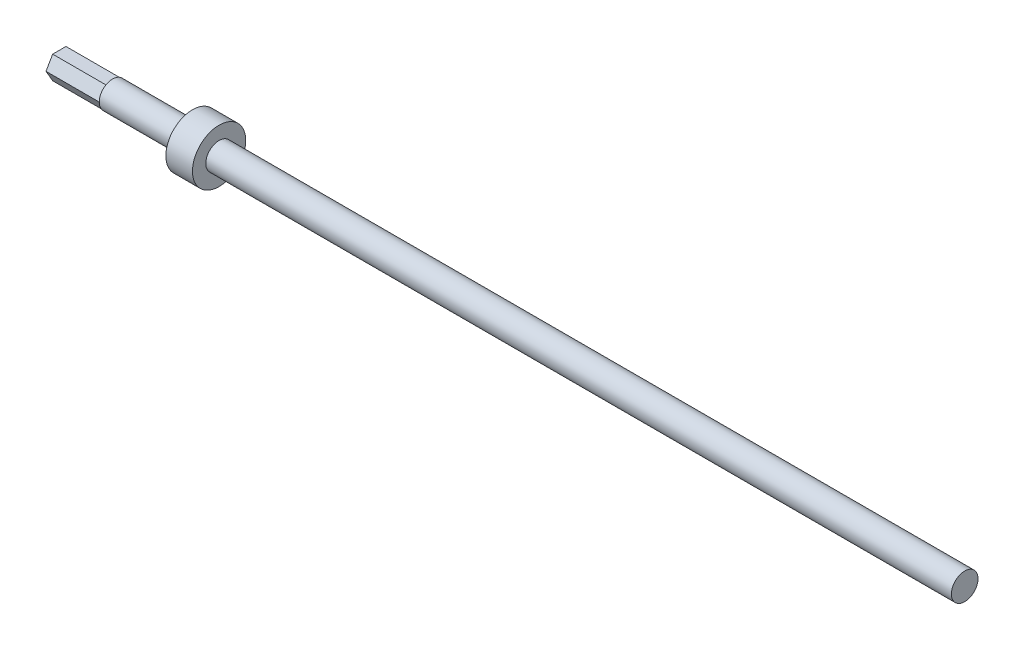
ISO-10303-21;
HEADER;
FILE_DESCRIPTION(('STEP AP214'),'2;1');
FILE_NAME('part.step','',(''),(''),'','','');
FILE_SCHEMA(('AUTOMOTIVE_DESIGN { 1 0 10303 214 1 1 1 1 }'));
ENDSEC;
DATA;
#1=APPLICATION_CONTEXT('core data for automotive mechanical design processes');
#2=APPLICATION_PROTOCOL_DEFINITION('international standard','automotive_design',2000,#1);
#3=PRODUCT_CONTEXT('',#1,'mechanical');
#4=PRODUCT('Part','Part','',(#3));
#5=PRODUCT_RELATED_PRODUCT_CATEGORY('part','',(#4));
#6=PRODUCT_DEFINITION_FORMATION('','',#4);
#7=PRODUCT_DEFINITION_CONTEXT('part definition',#1,'design');
#8=PRODUCT_DEFINITION('design','',#6,#7);
#9=PRODUCT_DEFINITION_SHAPE('','',#8);
#10=(LENGTH_UNIT() NAMED_UNIT(*) SI_UNIT(.MILLI.,.METRE.));
#11=(NAMED_UNIT(*) PLANE_ANGLE_UNIT() SI_UNIT($,.RADIAN.));
#12=(NAMED_UNIT(*) SI_UNIT($,.STERADIAN.) SOLID_ANGLE_UNIT());
#13=UNCERTAINTY_MEASURE_WITH_UNIT(LENGTH_MEASURE(1.E-05),#10,'distance_accuracy_value','');
#14=(GEOMETRIC_REPRESENTATION_CONTEXT(3) GLOBAL_UNCERTAINTY_ASSIGNED_CONTEXT((#13)) GLOBAL_UNIT_ASSIGNED_CONTEXT((#10,
#11,#12)) REPRESENTATION_CONTEXT('',''));
#15=CARTESIAN_POINT('',(0.,0.,0.));
#16=DIRECTION('',(0.,0.,1.));
#17=DIRECTION('',(1.,0.,0.));
#18=AXIS2_PLACEMENT_3D('',#15,#16,#17);
#19=CARTESIAN_POINT('',(-37.1803604252952,0.,0.));
#20=DIRECTION('',(1.,0.,0.));
#21=DIRECTION('',(0.,0.,-1.));
#22=AXIS2_PLACEMENT_3D('',#19,#20,#21);
#23=PLANE('',#22);
#24=DIRECTION('',(0.,0.,1.));
#25=VECTOR('',#24,1.);
#26=CARTESIAN_POINT('',(-37.1803604252952,-5.49926131403119,-3.175));
#27=LINE('',#26,#25);
#28=CARTESIAN_POINT('',(-37.1803604252952,-5.49926131403119,-3.175));
#29=VERTEX_POINT('',#28);
#30=CARTESIAN_POINT('',(-37.1803604252952,-5.49926131403119,3.175));
#31=VERTEX_POINT('',#30);
#32=EDGE_CURVE('E52',#29,#31,#27,.T.);
#33=ORIENTED_EDGE('',*,*,#32,.F.);
#34=CARTESIAN_POINT('',(-37.1803604252952,0.,0.));
#35=DIRECTION('',(-1.,0.,0.));
#36=DIRECTION('',(0.,0.,1.));
#37=AXIS2_PLACEMENT_3D('',#34,#35,#36);
#38=CIRCLE('',#37,6.35);
#39=EDGE_CURVE('E128',#29,#31,#38,.T.);
#40=ORIENTED_EDGE('',*,*,#39,.T.);
#41=EDGE_LOOP('',(#33,#40));
#42=FACE_BOUND('',#41,.T.);
#43=ADVANCED_FACE('F31',(#42),#23,.F.);
#44=DIRECTION('',(0.,-0.866025403784439,0.5));
#45=VECTOR('',#44,1.);
#46=CARTESIAN_POINT('',(-37.1803604252952,0.,-6.35));
#47=LINE('',#46,#45);
#48=CARTESIAN_POINT('',(-37.1803604252952,0.,-6.35));
#49=VERTEX_POINT('',#48);
#50=EDGE_CURVE('E105',#49,#29,#47,.T.);
#51=ORIENTED_EDGE('',*,*,#50,.F.);
#52=EDGE_CURVE('E130',#49,#29,#38,.T.);
#53=ORIENTED_EDGE('',*,*,#52,.T.);
#54=EDGE_LOOP('',(#51,#53));
#55=FACE_BOUND('',#54,.T.);
#56=ADVANCED_FACE('F196',(#55),#23,.F.);
#57=DIRECTION('',(0.,-0.866025403784439,-0.5));
#58=VECTOR('',#57,1.);
#59=CARTESIAN_POINT('',(-37.1803604252952,5.49926131403119,-3.175));
#60=LINE('',#59,#58);
#61=CARTESIAN_POINT('',(-37.1803604252952,5.49926131403119,-3.175));
#62=VERTEX_POINT('',#61);
#63=EDGE_CURVE('E156',#62,#49,#60,.T.);
#64=ORIENTED_EDGE('',*,*,#63,.F.);
#65=EDGE_CURVE('E132',#62,#49,#38,.T.);
#66=ORIENTED_EDGE('',*,*,#65,.T.);
#67=EDGE_LOOP('',(#64,#66));
#68=FACE_BOUND('',#67,.T.);
#69=ADVANCED_FACE('F200',(#68),#23,.F.);
#70=DIRECTION('',(0.,0.,-1.));
#71=VECTOR('',#70,1.);
#72=CARTESIAN_POINT('',(-37.1803604252952,5.49926131403118,3.175));
#73=LINE('',#72,#71);
#74=CARTESIAN_POINT('',(-37.1803604252952,5.49926131403118,3.175));
#75=VERTEX_POINT('',#74);
#76=EDGE_CURVE('E145',#75,#62,#73,.T.);
#77=ORIENTED_EDGE('',*,*,#76,.F.);
#78=EDGE_CURVE('E38',#75,#62,#38,.T.);
#79=ORIENTED_EDGE('',*,*,#78,.T.);
#80=EDGE_LOOP('',(#77,#79));
#81=FACE_BOUND('',#80,.T.);
#82=ADVANCED_FACE('F144',(#81),#23,.F.);
#83=DIRECTION('',(0.,0.866025403784439,-0.5));
#84=VECTOR('',#83,1.);
#85=CARTESIAN_POINT('',(-37.1803604252952,0.,6.35));
#86=LINE('',#85,#84);
#87=CARTESIAN_POINT('',(-37.1803604252952,0.,6.35));
#88=VERTEX_POINT('',#87);
#89=EDGE_CURVE('E157',#88,#75,#86,.T.);
#90=ORIENTED_EDGE('',*,*,#89,.F.);
#91=EDGE_CURVE('E11',#88,#75,#38,.T.);
#92=ORIENTED_EDGE('',*,*,#91,.T.);
#93=EDGE_LOOP('',(#90,#92));
#94=FACE_BOUND('',#93,.T.);
#95=ADVANCED_FACE('F183',(#94),#23,.F.);
#96=DIRECTION('',(0.,0.866025403784439,0.5));
#97=VECTOR('',#96,1.);
#98=CARTESIAN_POINT('',(-37.1803604252952,-5.49926131403119,3.175));
#99=LINE('',#98,#97);
#100=EDGE_CURVE('E45',#31,#88,#99,.T.);
#101=ORIENTED_EDGE('',*,*,#100,.F.);
#102=EDGE_CURVE('E39',#31,#88,#38,.T.);
#103=ORIENTED_EDGE('',*,*,#102,.T.);
#104=EDGE_LOOP('',(#101,#103));
#105=FACE_BOUND('',#104,.T.);
#106=ADVANCED_FACE('F187',(#105),#23,.F.);
#107=CARTESIAN_POINT('',(-42.0558444796484,0.,0.));
#108=DIRECTION('',(-1.,0.,0.));
#109=DIRECTION('',(0.,0.,1.));
#110=AXIS2_PLACEMENT_3D('',#107,#108,#109);
#111=CYLINDRICAL_SURFACE('',#110,6.35);
#112=ORIENTED_EDGE('',*,*,#91,.F.);
#113=ORIENTED_EDGE('',*,*,#102,.F.);
#114=ORIENTED_EDGE('',*,*,#39,.F.);
#115=ORIENTED_EDGE('',*,*,#52,.F.);
#116=ORIENTED_EDGE('',*,*,#65,.F.);
#117=ORIENTED_EDGE('',*,*,#78,.F.);
#118=EDGE_LOOP('',(#112,#113,#114,#115,#116,#117));
#119=FACE_BOUND('',#118,.T.);
#120=CARTESIAN_POINT('',(0.919639574704825,0.,0.));
#121=DIRECTION('',(-1.,0.,0.));
#122=DIRECTION('',(0.,0.,1.));
#123=AXIS2_PLACEMENT_3D('',#120,#121,#122);
#124=CIRCLE('',#123,6.35);
#125=CARTESIAN_POINT('',(0.919639574704825,0.,6.35));
#126=VERTEX_POINT('',#125);
#127=EDGE_CURVE('E124',#126,#126,#124,.T.);
#128=ORIENTED_EDGE('',*,*,#127,.T.);
#129=EDGE_LOOP('',(#128));
#130=FACE_BOUND('',#129,.T.);
#131=ADVANCED_FACE('F184',(#119,#130),#111,.T.);
#132=CARTESIAN_POINT('',(0.919639574704825,6.35,0.));
#133=DIRECTION('',(1.,0.,0.));
#134=DIRECTION('',(0.,0.,-1.));
#135=AXIS2_PLACEMENT_3D('',#132,#133,#134);
#136=PLANE('',#135);
#137=ORIENTED_EDGE('',*,*,#127,.F.);
#138=EDGE_LOOP('',(#137));
#139=FACE_BOUND('',#138,.T.);
#140=CARTESIAN_POINT('',(0.919639574704825,0.,0.));
#141=DIRECTION('',(-1.,0.,0.));
#142=DIRECTION('',(0.,0.,1.));
#143=AXIS2_PLACEMENT_3D('',#140,#141,#142);
#144=CIRCLE('',#143,12.7);
#145=CARTESIAN_POINT('',(0.919639574704825,0.,12.7));
#146=VERTEX_POINT('',#145);
#147=EDGE_CURVE('E122',#146,#146,#144,.T.);
#148=ORIENTED_EDGE('',*,*,#147,.T.);
#149=EDGE_LOOP('',(#148));
#150=FACE_BOUND('',#149,.T.);
#151=ADVANCED_FACE('F186',(#139,#150),#136,.F.);
#152=CARTESIAN_POINT('',(-42.0558444796484,0.,0.));
#153=DIRECTION('',(-1.,0.,0.));
#154=DIRECTION('',(0.,0.,1.));
#155=AXIS2_PLACEMENT_3D('',#152,#153,#154);
#156=CYLINDRICAL_SURFACE('',#155,12.7);
#157=ORIENTED_EDGE('',*,*,#147,.F.);
#158=EDGE_LOOP('',(#157));
#159=FACE_BOUND('',#158,.T.);
#160=CARTESIAN_POINT('',(13.6196395747048,0.,0.));
#161=DIRECTION('',(-1.,0.,0.));
#162=DIRECTION('',(0.,0.,1.));
#163=AXIS2_PLACEMENT_3D('',#160,#161,#162);
#164=CIRCLE('',#163,12.7);
#165=CARTESIAN_POINT('',(13.6196395747048,0.,12.7));
#166=VERTEX_POINT('',#165);
#167=EDGE_CURVE('E119',#166,#166,#164,.T.);
#168=ORIENTED_EDGE('',*,*,#167,.T.);
#169=EDGE_LOOP('',(#168));
#170=FACE_BOUND('',#169,.T.);
#171=ADVANCED_FACE('F192',(#159,#170),#156,.T.);
#172=CARTESIAN_POINT('',(13.6196395747048,12.7,0.));
#173=DIRECTION('',(-1.,0.,0.));
#174=DIRECTION('',(0.,0.,1.));
#175=AXIS2_PLACEMENT_3D('',#172,#173,#174);
#176=PLANE('',#175);
#177=ORIENTED_EDGE('',*,*,#167,.F.);
#178=EDGE_LOOP('',(#177));
#179=FACE_BOUND('',#178,.T.);
#180=CARTESIAN_POINT('',(13.6196395747048,0.,0.));
#181=DIRECTION('',(-1.,0.,0.));
#182=DIRECTION('',(0.,0.,1.));
#183=AXIS2_PLACEMENT_3D('',#180,#181,#182);
#184=CIRCLE('',#183,6.35);
#185=CARTESIAN_POINT('',(13.6196395747048,0.,6.35));
#186=VERTEX_POINT('',#185);
#187=EDGE_CURVE('E111',#186,#186,#184,.T.);
#188=ORIENTED_EDGE('',*,*,#187,.T.);
#189=EDGE_LOOP('',(#188));
#190=FACE_BOUND('',#189,.T.);
#191=ADVANCED_FACE('F230',(#179,#190),#176,.F.);
#192=CARTESIAN_POINT('',(-42.0558444796484,0.,0.));
#193=DIRECTION('',(-1.,0.,0.));
#194=DIRECTION('',(0.,0.,1.));
#195=AXIS2_PLACEMENT_3D('',#192,#193,#194);
#196=CYLINDRICAL_SURFACE('',#195,6.35);
#197=ORIENTED_EDGE('',*,*,#187,.F.);
#198=EDGE_LOOP('',(#197));
#199=FACE_BOUND('',#198,.T.);
#200=CARTESIAN_POINT('',(369.219639574705,0.,0.));
#201=DIRECTION('',(-1.,0.,0.));
#202=DIRECTION('',(0.,0.,1.));
#203=AXIS2_PLACEMENT_3D('',#200,#201,#202);
#204=CIRCLE('',#203,6.35);
#205=CARTESIAN_POINT('',(369.219639574705,0.,6.35));
#206=VERTEX_POINT('',#205);
#207=EDGE_CURVE('E108',#206,#206,#204,.T.);
#208=ORIENTED_EDGE('',*,*,#207,.T.);
#209=EDGE_LOOP('',(#208));
#210=FACE_BOUND('',#209,.T.);
#211=ADVANCED_FACE('F226',(#199,#210),#196,.T.);
#212=CARTESIAN_POINT('',(369.219639574705,6.35,0.));
#213=DIRECTION('',(-1.,0.,0.));
#214=DIRECTION('',(0.,0.,1.));
#215=AXIS2_PLACEMENT_3D('',#212,#213,#214);
#216=PLANE('',#215);
#217=ORIENTED_EDGE('',*,*,#207,.F.);
#218=EDGE_LOOP('',(#217));
#219=FACE_BOUND('',#218,.T.);
#220=ADVANCED_FACE('F223',(#219),#216,.F.);
#221=CARTESIAN_POINT('',(-62.5803604252952,-5.49926131403119,-3.175));
#222=DIRECTION('',(0.,1.,0.));
#223=DIRECTION('',(0.,0.,1.));
#224=AXIS2_PLACEMENT_3D('',#221,#222,#223);
#225=PLANE('',#224);
#226=ORIENTED_EDGE('',*,*,#32,.T.);
#227=DIRECTION('',(1.,0.,0.));
#228=VECTOR('',#227,1.);
#229=CARTESIAN_POINT('',(-62.5803604252952,-5.49926131403119,3.175));
#230=LINE('',#229,#228);
#231=CARTESIAN_POINT('',(-62.5803604252952,-5.49926131403119,3.175));
#232=VERTEX_POINT('',#231);
#233=EDGE_CURVE('E90',#232,#31,#230,.T.);
#234=ORIENTED_EDGE('',*,*,#233,.F.);
#235=DIRECTION('',(0.,0.,1.));
#236=VECTOR('',#235,1.);
#237=CARTESIAN_POINT('',(-62.5803604252952,-5.49926131403119,-3.175));
#238=LINE('',#237,#236);
#239=CARTESIAN_POINT('',(-62.5803604252952,-5.49926131403119,-3.175));
#240=VERTEX_POINT('',#239);
#241=EDGE_CURVE('E96',#240,#232,#238,.T.);
#242=ORIENTED_EDGE('',*,*,#241,.F.);
#243=DIRECTION('',(1.,0.,0.));
#244=VECTOR('',#243,1.);
#245=CARTESIAN_POINT('',(-62.5803604252952,-5.49926131403119,-3.175));
#246=LINE('',#245,#244);
#247=EDGE_CURVE('E166',#240,#29,#246,.T.);
#248=ORIENTED_EDGE('',*,*,#247,.T.);
#249=EDGE_LOOP('',(#226,#234,#242,#248));
#250=FACE_BOUND('',#249,.T.);
#251=ADVANCED_FACE('F107',(#250),#225,.F.);
#252=CARTESIAN_POINT('',(-62.5803604252952,-5.49926131403119,3.175));
#253=DIRECTION('',(0.,0.5,-0.866025403784439));
#254=DIRECTION('',(0.,0.866025403784439,0.5));
#255=AXIS2_PLACEMENT_3D('',#252,#253,#254);
#256=PLANE('',#255);
#257=ORIENTED_EDGE('',*,*,#100,.T.);
#258=DIRECTION('',(1.,0.,0.));
#259=VECTOR('',#258,1.);
#260=CARTESIAN_POINT('',(-62.5803604252952,0.,6.35));
#261=LINE('',#260,#259);
#262=CARTESIAN_POINT('',(-62.5803604252952,0.,6.35));
#263=VERTEX_POINT('',#262);
#264=EDGE_CURVE('E92',#263,#88,#261,.T.);
#265=ORIENTED_EDGE('',*,*,#264,.F.);
#266=DIRECTION('',(0.,0.866025403784439,0.5));
#267=VECTOR('',#266,1.);
#268=CARTESIAN_POINT('',(-62.5803604252952,-5.49926131403119,3.175));
#269=LINE('',#268,#267);
#270=EDGE_CURVE('E86',#232,#263,#269,.T.);
#271=ORIENTED_EDGE('',*,*,#270,.F.);
#272=ORIENTED_EDGE('',*,*,#233,.T.);
#273=EDGE_LOOP('',(#257,#265,#271,#272));
#274=FACE_BOUND('',#273,.T.);
#275=ADVANCED_FACE('F88',(#274),#256,.F.);
#276=CARTESIAN_POINT('',(-62.5803604252952,0.,6.35));
#277=DIRECTION('',(0.,-0.5,-0.866025403784439));
#278=DIRECTION('',(0.,0.866025403784439,-0.5));
#279=AXIS2_PLACEMENT_3D('',#276,#277,#278);
#280=PLANE('',#279);
#281=ORIENTED_EDGE('',*,*,#89,.T.);
#282=DIRECTION('',(1.,0.,0.));
#283=VECTOR('',#282,1.);
#284=CARTESIAN_POINT('',(-62.5803604252952,5.49926131403118,3.175));
#285=LINE('',#284,#283);
#286=CARTESIAN_POINT('',(-62.5803604252952,5.49926131403118,3.175));
#287=VERTEX_POINT('',#286);
#288=EDGE_CURVE('E113',#287,#75,#285,.T.);
#289=ORIENTED_EDGE('',*,*,#288,.F.);
#290=DIRECTION('',(0.,0.866025403784439,-0.5));
#291=VECTOR('',#290,1.);
#292=CARTESIAN_POINT('',(-62.5803604252952,0.,6.35));
#293=LINE('',#292,#291);
#294=EDGE_CURVE('E95',#263,#287,#293,.T.);
#295=ORIENTED_EDGE('',*,*,#294,.F.);
#296=ORIENTED_EDGE('',*,*,#264,.T.);
#297=EDGE_LOOP('',(#281,#289,#295,#296));
#298=FACE_BOUND('',#297,.T.);
#299=ADVANCED_FACE('F181',(#298),#280,.F.);
#300=CARTESIAN_POINT('',(-62.5803604252952,5.49926131403118,3.175));
#301=DIRECTION('',(0.,-1.,0.));
#302=DIRECTION('',(0.,0.,-1.));
#303=AXIS2_PLACEMENT_3D('',#300,#301,#302);
#304=PLANE('',#303);
#305=ORIENTED_EDGE('',*,*,#76,.T.);
#306=DIRECTION('',(1.,0.,0.));
#307=VECTOR('',#306,1.);
#308=CARTESIAN_POINT('',(-62.5803604252952,5.49926131403119,-3.175));
#309=LINE('',#308,#307);
#310=CARTESIAN_POINT('',(-62.5803604252952,5.49926131403119,-3.175));
#311=VERTEX_POINT('',#310);
#312=EDGE_CURVE('E153',#311,#62,#309,.T.);
#313=ORIENTED_EDGE('',*,*,#312,.F.);
#314=DIRECTION('',(0.,0.,-1.));
#315=VECTOR('',#314,1.);
#316=CARTESIAN_POINT('',(-62.5803604252952,5.49926131403118,3.175));
#317=LINE('',#316,#315);
#318=EDGE_CURVE('E178',#287,#311,#317,.T.);
#319=ORIENTED_EDGE('',*,*,#318,.F.);
#320=ORIENTED_EDGE('',*,*,#288,.T.);
#321=EDGE_LOOP('',(#305,#313,#319,#320));
#322=FACE_BOUND('',#321,.T.);
#323=ADVANCED_FACE('F151',(#322),#304,.F.);
#324=CARTESIAN_POINT('',(-62.5803604252952,5.49926131403119,-3.175));
#325=DIRECTION('',(0.,-0.5,0.866025403784438));
#326=DIRECTION('',(0.,-0.866025403784439,-0.5));
#327=AXIS2_PLACEMENT_3D('',#324,#325,#326);
#328=PLANE('',#327);
#329=ORIENTED_EDGE('',*,*,#63,.T.);
#330=DIRECTION('',(1.,0.,0.));
#331=VECTOR('',#330,1.);
#332=CARTESIAN_POINT('',(-62.5803604252952,0.,-6.35));
#333=LINE('',#332,#331);
#334=CARTESIAN_POINT('',(-62.5803604252952,0.,-6.35));
#335=VERTEX_POINT('',#334);
#336=EDGE_CURVE('E164',#335,#49,#333,.T.);
#337=ORIENTED_EDGE('',*,*,#336,.F.);
#338=DIRECTION('',(0.,-0.866025403784439,-0.5));
#339=VECTOR('',#338,1.);
#340=CARTESIAN_POINT('',(-62.5803604252952,5.49926131403119,-3.175));
#341=LINE('',#340,#339);
#342=EDGE_CURVE('E163',#311,#335,#341,.T.);
#343=ORIENTED_EDGE('',*,*,#342,.F.);
#344=ORIENTED_EDGE('',*,*,#312,.T.);
#345=EDGE_LOOP('',(#329,#337,#343,#344));
#346=FACE_BOUND('',#345,.T.);
#347=ADVANCED_FACE('F160',(#346),#328,.F.);
#348=CARTESIAN_POINT('',(-62.5803604252952,0.,-6.35));
#349=DIRECTION('',(0.,0.5,0.866025403784439));
#350=DIRECTION('',(0.,-0.866025403784439,0.5));
#351=AXIS2_PLACEMENT_3D('',#348,#349,#350);
#352=PLANE('',#351);
#353=ORIENTED_EDGE('',*,*,#50,.T.);
#354=ORIENTED_EDGE('',*,*,#247,.F.);
#355=DIRECTION('',(0.,-0.866025403784439,0.5));
#356=VECTOR('',#355,1.);
#357=CARTESIAN_POINT('',(-62.5803604252952,0.,-6.35));
#358=LINE('',#357,#356);
#359=EDGE_CURVE('E101',#335,#240,#358,.T.);
#360=ORIENTED_EDGE('',*,*,#359,.F.);
#361=ORIENTED_EDGE('',*,*,#336,.T.);
#362=EDGE_LOOP('',(#353,#354,#360,#361));
#363=FACE_BOUND('',#362,.T.);
#364=ADVANCED_FACE('F205',(#363),#352,.F.);
#365=CARTESIAN_POINT('',(-62.5803604252952,-5.49926131403119,3.175));
#366=DIRECTION('',(-1.,0.,0.));
#367=DIRECTION('',(0.,0.,1.));
#368=AXIS2_PLACEMENT_3D('',#365,#366,#367);
#369=PLANE('',#368);
#370=ORIENTED_EDGE('',*,*,#241,.T.);
#371=ORIENTED_EDGE('',*,*,#270,.T.);
#372=ORIENTED_EDGE('',*,*,#294,.T.);
#373=ORIENTED_EDGE('',*,*,#318,.T.);
#374=ORIENTED_EDGE('',*,*,#342,.T.);
#375=ORIENTED_EDGE('',*,*,#359,.T.);
#376=EDGE_LOOP('',(#370,#371,#372,#373,#374,#375));
#377=FACE_BOUND('',#376,.T.);
#378=ADVANCED_FACE('F99',(#377),#369,.T.);
#379=CLOSED_SHELL('',(#43,#56,#69,#82,#95,#106,#131,#151,#171,#191,#211,#220,#251,#275,#299,
#323,#347,#364,#378));
#380=MANIFOLD_SOLID_BREP('B2',#379);
#381=ADVANCED_BREP_SHAPE_REPRESENTATION('',(#18,#380),#14);
#382=SHAPE_DEFINITION_REPRESENTATION(#9,#381);
ENDSEC;
END-ISO-10303-21;
